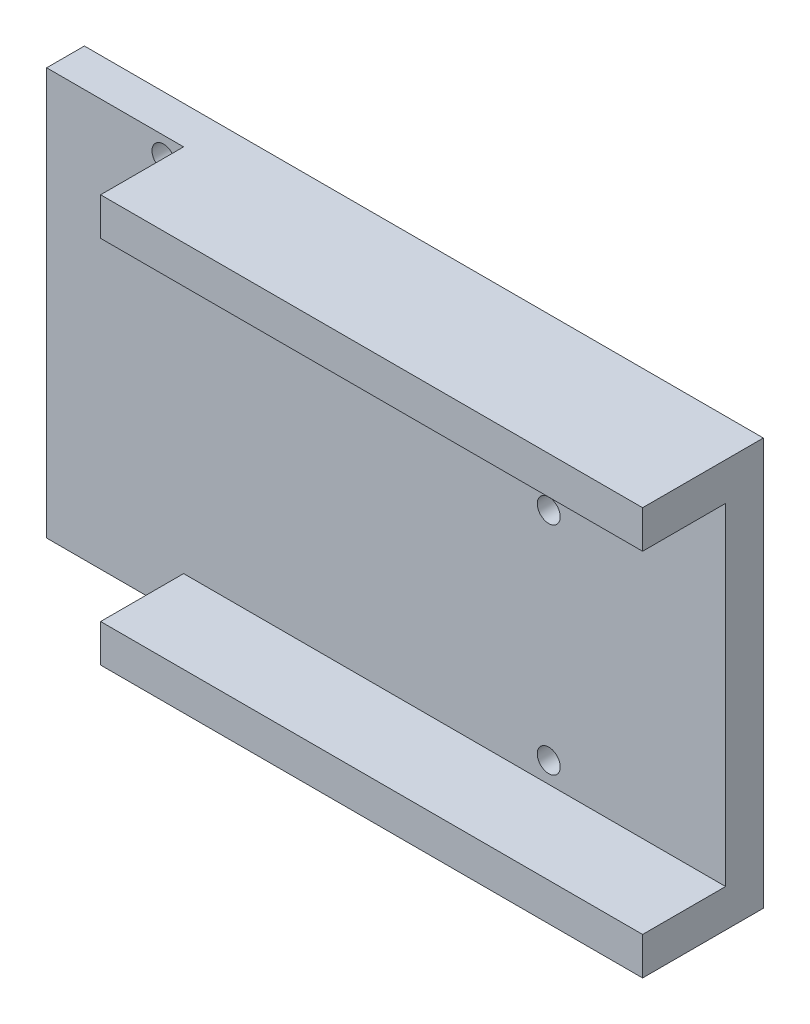
ISO-10303-21;
HEADER;
FILE_DESCRIPTION(('STEP AP214'),'2;1');
FILE_NAME('part.step','',(''),(''),'','','');
FILE_SCHEMA(('AUTOMOTIVE_DESIGN { 1 0 10303 214 1 1 1 1 }'));
ENDSEC;
DATA;
#1=APPLICATION_CONTEXT('core data for automotive mechanical design processes');
#2=APPLICATION_PROTOCOL_DEFINITION('international standard','automotive_design',2000,#1);
#3=PRODUCT_CONTEXT('',#1,'mechanical');
#4=PRODUCT('Part','Part','',(#3));
#5=PRODUCT_RELATED_PRODUCT_CATEGORY('part','',(#4));
#6=PRODUCT_DEFINITION_FORMATION('','',#4);
#7=PRODUCT_DEFINITION_CONTEXT('part definition',#1,'design');
#8=PRODUCT_DEFINITION('design','',#6,#7);
#9=PRODUCT_DEFINITION_SHAPE('','',#8);
#10=(LENGTH_UNIT() NAMED_UNIT(*) SI_UNIT(.MILLI.,.METRE.));
#11=(NAMED_UNIT(*) PLANE_ANGLE_UNIT() SI_UNIT($,.RADIAN.));
#12=(NAMED_UNIT(*) SI_UNIT($,.STERADIAN.) SOLID_ANGLE_UNIT());
#13=UNCERTAINTY_MEASURE_WITH_UNIT(LENGTH_MEASURE(1.E-05),#10,'distance_accuracy_value','');
#14=(GEOMETRIC_REPRESENTATION_CONTEXT(3) GLOBAL_UNCERTAINTY_ASSIGNED_CONTEXT((#13)) GLOBAL_UNIT_ASSIGNED_CONTEXT((#10,
#11,#12)) REPRESENTATION_CONTEXT('',''));
#15=CARTESIAN_POINT('',(0.,0.,0.));
#16=DIRECTION('',(0.,0.,1.));
#17=DIRECTION('',(1.,0.,0.));
#18=AXIS2_PLACEMENT_3D('',#15,#16,#17);
#19=CARTESIAN_POINT('',(0.,0.,0.));
#20=DIRECTION('',(0.,0.,1.));
#21=DIRECTION('',(1.,0.,0.));
#22=AXIS2_PLACEMENT_3D('',#19,#20,#21);
#23=PLANE('',#22);
#24=DIRECTION('',(0.,-1.,0.));
#25=VECTOR('',#24,1.);
#26=CARTESIAN_POINT('',(-102.427676306582,-480.783640454203,0.));
#27=LINE('',#26,#25);
#28=CARTESIAN_POINT('',(-102.427676306582,-529.758240403403,0.));
#29=VERTEX_POINT('',#28);
#30=CARTESIAN_POINT('',(-102.427676306582,-534.758240403403,0.));
#31=VERTEX_POINT('',#30);
#32=EDGE_CURVE('E189',#29,#31,#27,.T.);
#33=ORIENTED_EDGE('',*,*,#32,.T.);
#34=DIRECTION('',(1.,0.,0.));
#35=VECTOR('',#34,1.);
#36=CARTESIAN_POINT('',(-120.576012603255,-534.758240403403,0.));
#37=LINE('',#36,#35);
#38=CARTESIAN_POINT('',(-30.6014126540554,-534.758240403403,0.));
#39=VERTEX_POINT('',#38);
#40=EDGE_CURVE('E157',#31,#39,#37,.T.);
#41=ORIENTED_EDGE('',*,*,#40,.T.);
#42=DIRECTION('',(0.,1.,0.));
#43=VECTOR('',#42,1.);
#44=CARTESIAN_POINT('',(-30.6014126540554,-480.783640454203,0.));
#45=LINE('',#44,#43);
#46=CARTESIAN_POINT('',(-30.6014126540554,-529.758240403403,0.));
#47=VERTEX_POINT('',#46);
#48=EDGE_CURVE('E160',#39,#47,#45,.T.);
#49=ORIENTED_EDGE('',*,*,#48,.T.);
#50=DIRECTION('',(1.,0.,0.));
#51=VECTOR('',#50,1.);
#52=CARTESIAN_POINT('',(0.,-529.758240403403,0.));
#53=LINE('',#52,#51);
#54=EDGE_CURVE('E202',#29,#47,#53,.T.);
#55=ORIENTED_EDGE('',*,*,#54,.F.);
#56=EDGE_LOOP('',(#33,#41,#49,#55));
#57=FACE_BOUND('',#56,.T.);
#58=ADVANCED_FACE('F39',(#57),#23,.T.);
#59=CARTESIAN_POINT('',(-120.576012603255,-480.783640454203,-16.));
#60=DIRECTION('',(-1.,0.,0.));
#61=DIRECTION('',(0.,0.,1.));
#62=AXIS2_PLACEMENT_3D('',#59,#60,#61);
#63=PLANE('',#62);
#64=DIRECTION('',(0.,-1.,0.));
#65=VECTOR('',#64,1.);
#66=CARTESIAN_POINT('',(-120.576012603255,-485.783640454203,-11.));
#67=LINE('',#66,#65);
#68=CARTESIAN_POINT('',(-120.576012603255,-480.783640454203,-11.));
#69=VERTEX_POINT('',#68);
#70=CARTESIAN_POINT('',(-120.576012603255,-534.758240403403,-11.));
#71=VERTEX_POINT('',#70);
#72=EDGE_CURVE('E125',#69,#71,#67,.T.);
#73=ORIENTED_EDGE('',*,*,#72,.F.);
#74=DIRECTION('',(0.,0.,1.));
#75=VECTOR('',#74,1.);
#76=CARTESIAN_POINT('',(-120.576012603255,-480.783640454203,-16.));
#77=LINE('',#76,#75);
#78=CARTESIAN_POINT('',(-120.576012603255,-480.783640454203,-16.));
#79=VERTEX_POINT('',#78);
#80=EDGE_CURVE('E11',#79,#69,#77,.T.);
#81=ORIENTED_EDGE('',*,*,#80,.F.);
#82=DIRECTION('',(0.,-1.,0.));
#83=VECTOR('',#82,1.);
#84=CARTESIAN_POINT('',(-120.576012603255,-480.783640454203,-16.));
#85=LINE('',#84,#83);
#86=CARTESIAN_POINT('',(-120.576012603255,-534.758240403403,-16.));
#87=VERTEX_POINT('',#86);
#88=EDGE_CURVE('E164',#79,#87,#85,.T.);
#89=ORIENTED_EDGE('',*,*,#88,.T.);
#90=DIRECTION('',(0.,0.,1.));
#91=VECTOR('',#90,1.);
#92=CARTESIAN_POINT('',(-120.576012603255,-534.758240403403,-16.));
#93=LINE('',#92,#91);
#94=EDGE_CURVE('E88',#87,#71,#93,.T.);
#95=ORIENTED_EDGE('',*,*,#94,.T.);
#96=EDGE_LOOP('',(#73,#81,#89,#95));
#97=FACE_BOUND('',#96,.T.);
#98=ADVANCED_FACE('F41',(#97),#63,.T.);
#99=CARTESIAN_POINT('',(-120.576012603255,-480.783640454203,-16.));
#100=DIRECTION('',(0.,1.,0.));
#101=DIRECTION('',(0.,0.,1.));
#102=AXIS2_PLACEMENT_3D('',#99,#100,#101);
#103=PLANE('',#102);
#104=DIRECTION('',(0.,0.,1.));
#105=VECTOR('',#104,1.);
#106=CARTESIAN_POINT('',(-102.427676306582,-480.783640454203,0.));
#107=LINE('',#106,#105);
#108=CARTESIAN_POINT('',(-102.427676306582,-480.783640454203,-11.));
#109=VERTEX_POINT('',#108);
#110=CARTESIAN_POINT('',(-102.427676306582,-480.783640454203,0.));
#111=VERTEX_POINT('',#110);
#112=EDGE_CURVE('E138',#109,#111,#107,.T.);
#113=ORIENTED_EDGE('',*,*,#112,.T.);
#114=DIRECTION('',(-1.,0.,0.));
#115=VECTOR('',#114,1.);
#116=CARTESIAN_POINT('',(-120.576012603255,-480.783640454203,0.));
#117=LINE('',#116,#115);
#118=CARTESIAN_POINT('',(-30.6014126540554,-480.783640454203,0.));
#119=VERTEX_POINT('',#118);
#120=EDGE_CURVE('E163',#119,#111,#117,.T.);
#121=ORIENTED_EDGE('',*,*,#120,.F.);
#122=DIRECTION('',(0.,0.,1.));
#123=VECTOR('',#122,1.);
#124=CARTESIAN_POINT('',(-30.6014126540554,-480.783640454203,-16.));
#125=LINE('',#124,#123);
#126=CARTESIAN_POINT('',(-30.6014126540554,-480.783640454203,-16.));
#127=VERTEX_POINT('',#126);
#128=EDGE_CURVE('E48',#127,#119,#125,.T.);
#129=ORIENTED_EDGE('',*,*,#128,.F.);
#130=DIRECTION('',(-1.,0.,0.));
#131=VECTOR('',#130,1.);
#132=CARTESIAN_POINT('',(-120.576012603255,-480.783640454203,-16.));
#133=LINE('',#132,#131);
#134=EDGE_CURVE('E144',#127,#79,#133,.T.);
#135=ORIENTED_EDGE('',*,*,#134,.T.);
#136=ORIENTED_EDGE('',*,*,#80,.T.);
#137=DIRECTION('',(1.,0.,0.));
#138=VECTOR('',#137,1.);
#139=CARTESIAN_POINT('',(-120.576012603255,-480.783640454203,-11.));
#140=LINE('',#139,#138);
#141=EDGE_CURVE('E131',#69,#109,#140,.T.);
#142=ORIENTED_EDGE('',*,*,#141,.T.);
#143=EDGE_LOOP('',(#113,#121,#129,#135,#136,#142));
#144=FACE_BOUND('',#143,.T.);
#145=ADVANCED_FACE('F142',(#144),#103,.T.);
#146=CARTESIAN_POINT('',(-30.6014126540554,-480.783640454203,-16.));
#147=DIRECTION('',(1.,0.,0.));
#148=DIRECTION('',(0.,1.,0.));
#149=AXIS2_PLACEMENT_3D('',#146,#147,#148);
#150=PLANE('',#149);
#151=DIRECTION('',(0.,0.,1.));
#152=VECTOR('',#151,1.);
#153=CARTESIAN_POINT('',(-30.6014126540554,-529.758240403403,0.));
#154=LINE('',#153,#152);
#155=CARTESIAN_POINT('',(-30.6014126540554,-529.758240403403,-11.));
#156=VERTEX_POINT('',#155);
#157=EDGE_CURVE('E200',#156,#47,#154,.T.);
#158=ORIENTED_EDGE('',*,*,#157,.T.);
#159=ORIENTED_EDGE('',*,*,#48,.F.);
#160=DIRECTION('',(0.,0.,1.));
#161=VECTOR('',#160,1.);
#162=CARTESIAN_POINT('',(-30.6014126540554,-534.758240403403,-16.));
#163=LINE('',#162,#161);
#164=CARTESIAN_POINT('',(-30.6014126540554,-534.758240403403,-16.));
#165=VERTEX_POINT('',#164);
#166=EDGE_CURVE('E151',#165,#39,#163,.T.);
#167=ORIENTED_EDGE('',*,*,#166,.F.);
#168=DIRECTION('',(0.,1.,0.));
#169=VECTOR('',#168,1.);
#170=CARTESIAN_POINT('',(-30.6014126540554,-480.783640454203,-16.));
#171=LINE('',#170,#169);
#172=EDGE_CURVE('E149',#165,#127,#171,.T.);
#173=ORIENTED_EDGE('',*,*,#172,.T.);
#174=ORIENTED_EDGE('',*,*,#128,.T.);
#175=CARTESIAN_POINT('',(-30.6014126540554,-485.783640454203,0.));
#176=VERTEX_POINT('',#175);
#177=EDGE_CURVE('E80',#176,#119,#45,.T.);
#178=ORIENTED_EDGE('',*,*,#177,.F.);
#179=DIRECTION('',(0.,0.,-1.));
#180=VECTOR('',#179,1.);
#181=CARTESIAN_POINT('',(-30.6014126540554,-485.783640454203,0.));
#182=LINE('',#181,#180);
#183=CARTESIAN_POINT('',(-30.6014126540554,-485.783640454203,-11.));
#184=VERTEX_POINT('',#183);
#185=EDGE_CURVE('E127',#176,#184,#182,.T.);
#186=ORIENTED_EDGE('',*,*,#185,.T.);
#187=DIRECTION('',(0.,-1.,0.));
#188=VECTOR('',#187,1.);
#189=CARTESIAN_POINT('',(-30.6014126540554,-485.783640454203,-11.));
#190=LINE('',#189,#188);
#191=EDGE_CURVE('E197',#184,#156,#190,.T.);
#192=ORIENTED_EDGE('',*,*,#191,.T.);
#193=EDGE_LOOP('',(#158,#159,#167,#173,#174,#178,#186,#192));
#194=FACE_BOUND('',#193,.T.);
#195=ADVANCED_FACE('F216',(#194),#150,.T.);
#196=CARTESIAN_POINT('',(-120.576012603255,-534.758240403403,-16.));
#197=DIRECTION('',(0.,-1.,0.));
#198=DIRECTION('',(0.,0.,-1.));
#199=AXIS2_PLACEMENT_3D('',#196,#197,#198);
#200=PLANE('',#199);
#201=DIRECTION('',(0.,0.,1.));
#202=VECTOR('',#201,1.);
#203=CARTESIAN_POINT('',(-102.427676306582,-534.758240403403,0.));
#204=LINE('',#203,#202);
#205=CARTESIAN_POINT('',(-102.427676306582,-534.758240403403,-11.));
#206=VERTEX_POINT('',#205);
#207=EDGE_CURVE('E139',#206,#31,#204,.T.);
#208=ORIENTED_EDGE('',*,*,#207,.F.);
#209=DIRECTION('',(1.,0.,0.));
#210=VECTOR('',#209,1.);
#211=CARTESIAN_POINT('',(-120.576012603255,-534.758240403403,-11.));
#212=LINE('',#211,#210);
#213=EDGE_CURVE('E177',#71,#206,#212,.T.);
#214=ORIENTED_EDGE('',*,*,#213,.F.);
#215=ORIENTED_EDGE('',*,*,#94,.F.);
#216=DIRECTION('',(1.,0.,0.));
#217=VECTOR('',#216,1.);
#218=CARTESIAN_POINT('',(-120.576012603255,-534.758240403403,-16.));
#219=LINE('',#218,#217);
#220=EDGE_CURVE('E153',#87,#165,#219,.T.);
#221=ORIENTED_EDGE('',*,*,#220,.T.);
#222=ORIENTED_EDGE('',*,*,#166,.T.);
#223=ORIENTED_EDGE('',*,*,#40,.F.);
#224=EDGE_LOOP('',(#208,#214,#215,#221,#222,#223));
#225=FACE_BOUND('',#224,.T.);
#226=ADVANCED_FACE('F211',(#225),#200,.T.);
#227=CARTESIAN_POINT('',(0.,0.,-16.));
#228=DIRECTION('',(0.,0.,1.));
#229=DIRECTION('',(1.,0.,0.));
#230=AXIS2_PLACEMENT_3D('',#227,#228,#229);
#231=PLANE('',#230);
#232=CARTESIAN_POINT('',(-105.092649636529,-483.310945508813,-16.));
#233=DIRECTION('',(0.,0.,1.));
#234=DIRECTION('',(1.,0.,0.));
#235=AXIS2_PLACEMENT_3D('',#232,#233,#234);
#236=CIRCLE('',#235,1.52400304800601);
#237=CARTESIAN_POINT('',(-103.568646588523,-483.310945508813,-16.));
#238=VERTEX_POINT('',#237);
#239=EDGE_CURVE('E172',#238,#238,#236,.T.);
#240=ORIENTED_EDGE('',*,*,#239,.T.);
#241=EDGE_LOOP('',(#240));
#242=FACE_BOUND('',#241,.T.);
#243=CARTESIAN_POINT('',(-54.0385475283255,-526.999032884983,-16.));
#244=DIRECTION('',(0.,0.,1.));
#245=DIRECTION('',(1.,0.,0.));
#246=AXIS2_PLACEMENT_3D('',#243,#244,#245);
#247=CIRCLE('',#246,1.52400304800602);
#248=CARTESIAN_POINT('',(-52.5145444803194,-526.999032884983,-16.));
#249=VERTEX_POINT('',#248);
#250=EDGE_CURVE('E262',#249,#249,#247,.T.);
#251=ORIENTED_EDGE('',*,*,#250,.T.);
#252=EDGE_LOOP('',(#251));
#253=FACE_BOUND('',#252,.T.);
#254=CARTESIAN_POINT('',(-54.0385475283255,-498.296975480873,-16.));
#255=DIRECTION('',(0.,0.,1.));
#256=DIRECTION('',(1.,0.,0.));
#257=AXIS2_PLACEMENT_3D('',#254,#255,#256);
#258=CIRCLE('',#257,1.52400304800604);
#259=CARTESIAN_POINT('',(-52.5145444803194,-498.296975480873,-16.));
#260=VERTEX_POINT('',#259);
#261=EDGE_CURVE('E265',#260,#260,#258,.T.);
#262=ORIENTED_EDGE('',*,*,#261,.T.);
#263=EDGE_LOOP('',(#262));
#264=FACE_BOUND('',#263,.T.);
#265=ORIENTED_EDGE('',*,*,#88,.F.);
#266=ORIENTED_EDGE('',*,*,#134,.F.);
#267=ORIENTED_EDGE('',*,*,#172,.F.);
#268=ORIENTED_EDGE('',*,*,#220,.F.);
#269=EDGE_LOOP('',(#265,#266,#267,#268));
#270=FACE_BOUND('',#269,.T.);
#271=ADVANCED_FACE('F214',(#242,#253,#264,#270),#231,.F.);
#272=CARTESIAN_POINT('',(-102.427676306582,-485.783640454203,0.));
#273=VERTEX_POINT('',#272);
#274=EDGE_CURVE('E185',#111,#273,#27,.T.);
#275=ORIENTED_EDGE('',*,*,#274,.T.);
#276=DIRECTION('',(-1.,0.,0.));
#277=VECTOR('',#276,1.);
#278=CARTESIAN_POINT('',(0.,-485.783640454203,0.));
#279=LINE('',#278,#277);
#280=EDGE_CURVE('E207',#176,#273,#279,.T.);
#281=ORIENTED_EDGE('',*,*,#280,.F.);
#282=ORIENTED_EDGE('',*,*,#177,.T.);
#283=ORIENTED_EDGE('',*,*,#120,.T.);
#284=EDGE_LOOP('',(#275,#281,#282,#283));
#285=FACE_BOUND('',#284,.T.);
#286=ADVANCED_FACE('F225',(#285),#23,.T.);
#287=CARTESIAN_POINT('',(-120.576012603255,-485.783640454203,-16.));
#288=DIRECTION('',(0.,1.,0.));
#289=DIRECTION('',(0.,0.,1.));
#290=AXIS2_PLACEMENT_3D('',#287,#288,#289);
#291=PLANE('',#290);
#292=ORIENTED_EDGE('',*,*,#280,.T.);
#293=DIRECTION('',(0.,0.,-1.));
#294=VECTOR('',#293,1.);
#295=CARTESIAN_POINT('',(-102.427676306582,-485.783640454203,-16.));
#296=LINE('',#295,#294);
#297=CARTESIAN_POINT('',(-102.427676306582,-485.783640454203,-11.));
#298=VERTEX_POINT('',#297);
#299=EDGE_CURVE('E128',#273,#298,#296,.T.);
#300=ORIENTED_EDGE('',*,*,#299,.T.);
#301=DIRECTION('',(-1.,0.,0.));
#302=VECTOR('',#301,1.);
#303=CARTESIAN_POINT('',(0.,-485.783640454203,-11.));
#304=LINE('',#303,#302);
#305=EDGE_CURVE('E159',#184,#298,#304,.T.);
#306=ORIENTED_EDGE('',*,*,#305,.F.);
#307=ORIENTED_EDGE('',*,*,#185,.F.);
#308=EDGE_LOOP('',(#292,#300,#306,#307));
#309=FACE_BOUND('',#308,.T.);
#310=ADVANCED_FACE('F228',(#309),#291,.F.);
#311=CARTESIAN_POINT('',(-120.576012603255,-529.758240403403,-16.));
#312=DIRECTION('',(0.,-1.,0.));
#313=DIRECTION('',(0.,0.,-1.));
#314=AXIS2_PLACEMENT_3D('',#311,#312,#313);
#315=PLANE('',#314);
#316=DIRECTION('',(1.,0.,0.));
#317=VECTOR('',#316,1.);
#318=CARTESIAN_POINT('',(0.,-529.758240403403,-11.));
#319=LINE('',#318,#317);
#320=CARTESIAN_POINT('',(-102.427676306582,-529.758240403403,-11.));
#321=VERTEX_POINT('',#320);
#322=EDGE_CURVE('E205',#321,#156,#319,.T.);
#323=ORIENTED_EDGE('',*,*,#322,.F.);
#324=DIRECTION('',(0.,0.,1.));
#325=VECTOR('',#324,1.);
#326=CARTESIAN_POINT('',(-102.427676306582,-529.758240403403,-16.));
#327=LINE('',#326,#325);
#328=EDGE_CURVE('E188',#321,#29,#327,.T.);
#329=ORIENTED_EDGE('',*,*,#328,.T.);
#330=ORIENTED_EDGE('',*,*,#54,.T.);
#331=ORIENTED_EDGE('',*,*,#157,.F.);
#332=EDGE_LOOP('',(#323,#329,#330,#331));
#333=FACE_BOUND('',#332,.T.);
#334=ADVANCED_FACE('F231',(#333),#315,.F.);
#335=CARTESIAN_POINT('',(0.,0.,-11.));
#336=DIRECTION('',(0.,0.,1.));
#337=DIRECTION('',(1.,0.,0.));
#338=AXIS2_PLACEMENT_3D('',#335,#336,#337);
#339=PLANE('',#338);
#340=CARTESIAN_POINT('',(-105.092649636529,-483.310945508813,-11.));
#341=DIRECTION('',(0.,0.,1.));
#342=DIRECTION('',(1.,0.,0.));
#343=AXIS2_PLACEMENT_3D('',#340,#341,#342);
#344=CIRCLE('',#343,1.52400304800601);
#345=CARTESIAN_POINT('',(-103.568646588523,-483.310945508813,-11.));
#346=VERTEX_POINT('',#345);
#347=EDGE_CURVE('E43',#346,#346,#344,.T.);
#348=ORIENTED_EDGE('',*,*,#347,.F.);
#349=EDGE_LOOP('',(#348));
#350=FACE_BOUND('',#349,.T.);
#351=CARTESIAN_POINT('',(-54.0385475283255,-526.999032884983,-11.));
#352=DIRECTION('',(0.,0.,1.));
#353=DIRECTION('',(1.,0.,0.));
#354=AXIS2_PLACEMENT_3D('',#351,#352,#353);
#355=CIRCLE('',#354,1.52400304800602);
#356=CARTESIAN_POINT('',(-52.5145444803194,-526.999032884983,-11.));
#357=VERTEX_POINT('',#356);
#358=EDGE_CURVE('E171',#357,#357,#355,.T.);
#359=ORIENTED_EDGE('',*,*,#358,.F.);
#360=EDGE_LOOP('',(#359));
#361=FACE_BOUND('',#360,.T.);
#362=CARTESIAN_POINT('',(-54.0385475283255,-498.296975480873,-11.));
#363=DIRECTION('',(0.,0.,1.));
#364=DIRECTION('',(1.,0.,0.));
#365=AXIS2_PLACEMENT_3D('',#362,#363,#364);
#366=CIRCLE('',#365,1.52400304800604);
#367=CARTESIAN_POINT('',(-52.5145444803194,-498.296975480873,-11.));
#368=VERTEX_POINT('',#367);
#369=EDGE_CURVE('E169',#368,#368,#366,.T.);
#370=ORIENTED_EDGE('',*,*,#369,.F.);
#371=EDGE_LOOP('',(#370));
#372=FACE_BOUND('',#371,.T.);
#373=ORIENTED_EDGE('',*,*,#305,.T.);
#374=DIRECTION('',(0.,-1.,0.));
#375=VECTOR('',#374,1.);
#376=CARTESIAN_POINT('',(-102.427676306582,-480.783640454203,-11.));
#377=LINE('',#376,#375);
#378=EDGE_CURVE('E134',#109,#298,#377,.T.);
#379=ORIENTED_EDGE('',*,*,#378,.F.);
#380=ORIENTED_EDGE('',*,*,#141,.F.);
#381=ORIENTED_EDGE('',*,*,#72,.T.);
#382=ORIENTED_EDGE('',*,*,#213,.T.);
#383=EDGE_CURVE('E56',#321,#206,#377,.T.);
#384=ORIENTED_EDGE('',*,*,#383,.F.);
#385=ORIENTED_EDGE('',*,*,#322,.T.);
#386=ORIENTED_EDGE('',*,*,#191,.F.);
#387=EDGE_LOOP('',(#373,#379,#380,#381,#382,#384,#385,#386));
#388=FACE_BOUND('',#387,.T.);
#389=ADVANCED_FACE('F133',(#350,#361,#372,#388),#339,.T.);
#390=CARTESIAN_POINT('',(-102.427676306582,-480.783640454203,0.));
#391=DIRECTION('',(1.,0.,0.));
#392=DIRECTION('',(0.,0.,-1.));
#393=AXIS2_PLACEMENT_3D('',#390,#391,#392);
#394=PLANE('',#393);
#395=ORIENTED_EDGE('',*,*,#383,.T.);
#396=ORIENTED_EDGE('',*,*,#207,.T.);
#397=ORIENTED_EDGE('',*,*,#32,.F.);
#398=ORIENTED_EDGE('',*,*,#328,.F.);
#399=EDGE_LOOP('',(#395,#396,#397,#398));
#400=FACE_BOUND('',#399,.T.);
#401=ADVANCED_FACE('F222',(#400),#394,.F.);
#402=ORIENTED_EDGE('',*,*,#274,.F.);
#403=ORIENTED_EDGE('',*,*,#112,.F.);
#404=ORIENTED_EDGE('',*,*,#378,.T.);
#405=ORIENTED_EDGE('',*,*,#299,.F.);
#406=EDGE_LOOP('',(#402,#403,#404,#405));
#407=FACE_BOUND('',#406,.T.);
#408=ADVANCED_FACE('F273',(#407),#394,.F.);
#409=CARTESIAN_POINT('',(-54.0385475283255,-498.296975480873,-16.));
#410=DIRECTION('',(0.,0.,1.));
#411=DIRECTION('',(1.,0.,0.));
#412=AXIS2_PLACEMENT_3D('',#409,#410,#411);
#413=CYLINDRICAL_SURFACE('',#412,1.52400304800604);
#414=ORIENTED_EDGE('',*,*,#369,.T.);
#415=EDGE_LOOP('',(#414));
#416=FACE_BOUND('',#415,.T.);
#417=ORIENTED_EDGE('',*,*,#261,.F.);
#418=EDGE_LOOP('',(#417));
#419=FACE_BOUND('',#418,.T.);
#420=ADVANCED_FACE('F270',(#416,#419),#413,.F.);
#421=CARTESIAN_POINT('',(-54.0385475283255,-526.999032884983,-16.));
#422=DIRECTION('',(0.,0.,1.));
#423=DIRECTION('',(1.,0.,0.));
#424=AXIS2_PLACEMENT_3D('',#421,#422,#423);
#425=CYLINDRICAL_SURFACE('',#424,1.52400304800602);
#426=ORIENTED_EDGE('',*,*,#358,.T.);
#427=EDGE_LOOP('',(#426));
#428=FACE_BOUND('',#427,.T.);
#429=ORIENTED_EDGE('',*,*,#250,.F.);
#430=EDGE_LOOP('',(#429));
#431=FACE_BOUND('',#430,.T.);
#432=ADVANCED_FACE('F272',(#428,#431),#425,.F.);
#433=CARTESIAN_POINT('',(-105.092649636529,-483.310945508813,-16.));
#434=DIRECTION('',(0.,0.,1.));
#435=DIRECTION('',(1.,0.,0.));
#436=AXIS2_PLACEMENT_3D('',#433,#434,#435);
#437=CYLINDRICAL_SURFACE('',#436,1.52400304800601);
#438=ORIENTED_EDGE('',*,*,#347,.T.);
#439=EDGE_LOOP('',(#438));
#440=FACE_BOUND('',#439,.T.);
#441=ORIENTED_EDGE('',*,*,#239,.F.);
#442=EDGE_LOOP('',(#441));
#443=FACE_BOUND('',#442,.T.);
#444=ADVANCED_FACE('F280',(#440,#443),#437,.F.);
#445=CLOSED_SHELL('',(#58,#98,#145,#195,#226,#271,#286,#310,#334,#389,#401,#408,#420,#432,#444));
#446=MANIFOLD_SOLID_BREP('B2',#445);
#447=ADVANCED_BREP_SHAPE_REPRESENTATION('',(#18,#446),#14);
#448=SHAPE_DEFINITION_REPRESENTATION(#9,#447);
ENDSEC;
END-ISO-10303-21;
